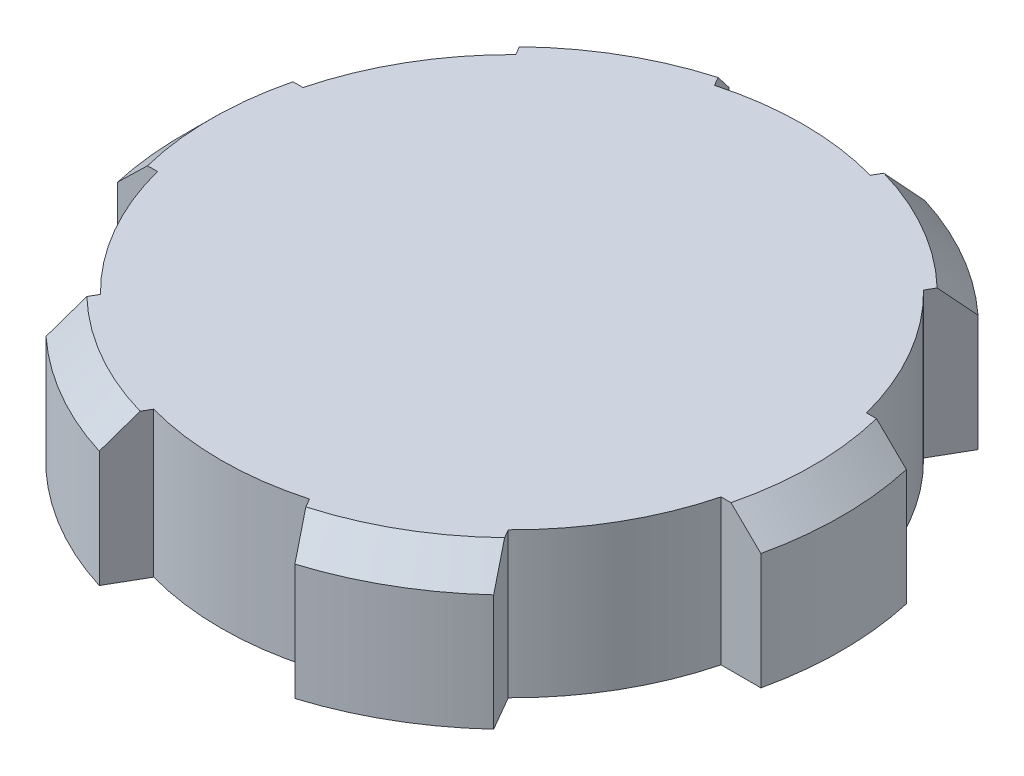
ISO-10303-21;
HEADER;
FILE_DESCRIPTION(('STEP AP214'),'2;1');
FILE_NAME('part.step','',(''),(''),'','','');
FILE_SCHEMA(('AUTOMOTIVE_DESIGN { 1 0 10303 214 1 1 1 1 }'));
ENDSEC;
DATA;
#1=APPLICATION_CONTEXT('core data for automotive mechanical design processes');
#2=APPLICATION_PROTOCOL_DEFINITION('international standard','automotive_design',2000,#1);
#3=PRODUCT_CONTEXT('',#1,'mechanical');
#4=PRODUCT('Part','Part','',(#3));
#5=PRODUCT_RELATED_PRODUCT_CATEGORY('part','',(#4));
#6=PRODUCT_DEFINITION_FORMATION('','',#4);
#7=PRODUCT_DEFINITION_CONTEXT('part definition',#1,'design');
#8=PRODUCT_DEFINITION('design','',#6,#7);
#9=PRODUCT_DEFINITION_SHAPE('','',#8);
#10=(LENGTH_UNIT() NAMED_UNIT(*) SI_UNIT(.MILLI.,.METRE.));
#11=(NAMED_UNIT(*) PLANE_ANGLE_UNIT() SI_UNIT($,.RADIAN.));
#12=(NAMED_UNIT(*) SI_UNIT($,.STERADIAN.) SOLID_ANGLE_UNIT());
#13=UNCERTAINTY_MEASURE_WITH_UNIT(LENGTH_MEASURE(1.E-05),#10,'distance_accuracy_value','');
#14=(GEOMETRIC_REPRESENTATION_CONTEXT(3) GLOBAL_UNCERTAINTY_ASSIGNED_CONTEXT((#13)) GLOBAL_UNIT_ASSIGNED_CONTEXT((#10,
#11,#12)) REPRESENTATION_CONTEXT('',''));
#15=CARTESIAN_POINT('',(0.,0.,0.));
#16=DIRECTION('',(0.,0.,1.));
#17=DIRECTION('',(1.,0.,0.));
#18=AXIS2_PLACEMENT_3D('',#15,#16,#17);
#19=CARTESIAN_POINT('',(0.,5.,0.));
#20=DIRECTION('',(0.,-1.,0.));
#21=DIRECTION('',(0.,0.,-1.));
#22=AXIS2_PLACEMENT_3D('',#19,#20,#21);
#23=CYLINDRICAL_SURFACE('',#22,10.);
#24=CARTESIAN_POINT('',(0.,0.,0.));
#25=DIRECTION('',(0.,1.,0.));
#26=DIRECTION('',(0.,0.,1.));
#27=AXIS2_PLACEMENT_3D('',#24,#25,#26);
#28=CIRCLE('',#27,10.);
#29=CARTESIAN_POINT('',(9.68245836551854,0.,-2.5));
#30=VERTEX_POINT('',#29);
#31=CARTESIAN_POINT('',(7.0062926922204,0.,-7.13525491562418));
#32=VERTEX_POINT('',#31);
#33=EDGE_CURVE('E267',#30,#32,#28,.T.);
#34=ORIENTED_EDGE('',*,*,#33,.T.);
#35=DIRECTION('',(0.,1.,0.));
#36=VECTOR('',#35,1.);
#37=CARTESIAN_POINT('',(7.0062926922204,-6.22460213425261,-7.13525491562418));
#38=LINE('',#37,#36);
#39=CARTESIAN_POINT('',(7.0062926922204,5.,-7.13525491562418));
#40=VERTEX_POINT('',#39);
#41=EDGE_CURVE('E278',#32,#40,#38,.T.);
#42=ORIENTED_EDGE('',*,*,#41,.T.);
#43=CARTESIAN_POINT('',(0.,5.,0.));
#44=DIRECTION('',(0.,1.,0.));
#45=DIRECTION('',(0.,0.,1.));
#46=AXIS2_PLACEMENT_3D('',#43,#44,#45);
#47=CIRCLE('',#46,10.);
#48=CARTESIAN_POINT('',(9.68245836551854,5.,-2.5));
#49=VERTEX_POINT('',#48);
#50=EDGE_CURVE('E405',#49,#40,#47,.T.);
#51=ORIENTED_EDGE('',*,*,#50,.F.);
#52=DIRECTION('',(0.,1.,0.));
#53=VECTOR('',#52,1.);
#54=CARTESIAN_POINT('',(9.68245836551854,-5.26508350095154,-2.5));
#55=LINE('',#54,#53);
#56=EDGE_CURVE('E398',#30,#49,#55,.T.);
#57=ORIENTED_EDGE('',*,*,#56,.F.);
#58=EDGE_LOOP('',(#34,#42,#51,#57));
#59=FACE_BOUND('',#58,.T.);
#60=ADVANCED_FACE('F53',(#59),#23,.T.);
#61=CARTESIAN_POINT('',(-9.68245836551854,0.,2.5));
#62=VERTEX_POINT('',#61);
#63=CARTESIAN_POINT('',(-7.0062926922204,0.,7.13525491562418));
#64=VERTEX_POINT('',#63);
#65=EDGE_CURVE('E411',#62,#64,#28,.T.);
#66=ORIENTED_EDGE('',*,*,#65,.T.);
#67=DIRECTION('',(0.,1.,0.));
#68=VECTOR('',#67,1.);
#69=CARTESIAN_POINT('',(-7.0062926922204,-6.22460213425261,7.13525491562418));
#70=LINE('',#69,#68);
#71=CARTESIAN_POINT('',(-7.0062926922204,5.,7.13525491562418));
#72=VERTEX_POINT('',#71);
#73=EDGE_CURVE('E305',#64,#72,#70,.T.);
#74=ORIENTED_EDGE('',*,*,#73,.T.);
#75=CARTESIAN_POINT('',(-9.68245836551854,5.,2.5));
#76=VERTEX_POINT('',#75);
#77=EDGE_CURVE('E408',#76,#72,#47,.T.);
#78=ORIENTED_EDGE('',*,*,#77,.F.);
#79=DIRECTION('',(0.,1.,0.));
#80=VECTOR('',#79,1.);
#81=CARTESIAN_POINT('',(-9.68245836551854,-5.26508350095154,2.5));
#82=LINE('',#81,#80);
#83=EDGE_CURVE('E374',#62,#76,#82,.T.);
#84=ORIENTED_EDGE('',*,*,#83,.F.);
#85=EDGE_LOOP('',(#66,#74,#78,#84));
#86=FACE_BOUND('',#85,.T.);
#87=ADVANCED_FACE('F660',(#86),#23,.T.);
#88=CARTESIAN_POINT('',(2.67616567329822,5.,-9.6352549156242));
#89=VERTEX_POINT('',#88);
#90=CARTESIAN_POINT('',(-2.67616567329815,5.,-9.63525491562422));
#91=VERTEX_POINT('',#90);
#92=EDGE_CURVE('E275',#89,#91,#47,.T.);
#93=ORIENTED_EDGE('',*,*,#92,.F.);
#94=DIRECTION('',(0.,1.,0.));
#95=VECTOR('',#94,1.);
#96=CARTESIAN_POINT('',(2.67616567329822,-6.22460213425261,-9.6352549156242));
#97=LINE('',#96,#95);
#98=CARTESIAN_POINT('',(2.67616567329822,0.,-9.6352549156242));
#99=VERTEX_POINT('',#98);
#100=EDGE_CURVE('E273',#99,#89,#97,.T.);
#101=ORIENTED_EDGE('',*,*,#100,.F.);
#102=CARTESIAN_POINT('',(-2.67616567329815,0.,-9.63525491562422));
#103=VERTEX_POINT('',#102);
#104=EDGE_CURVE('E256',#99,#103,#28,.T.);
#105=ORIENTED_EDGE('',*,*,#104,.T.);
#106=DIRECTION('',(0.,1.,0.));
#107=VECTOR('',#106,1.);
#108=CARTESIAN_POINT('',(-2.67616567329815,-6.2246021342526,-9.63525491562422));
#109=LINE('',#108,#107);
#110=EDGE_CURVE('E326',#103,#91,#109,.T.);
#111=ORIENTED_EDGE('',*,*,#110,.T.);
#112=EDGE_LOOP('',(#93,#101,#105,#111));
#113=FACE_BOUND('',#112,.T.);
#114=ADVANCED_FACE('F274',(#113),#23,.T.);
#115=CARTESIAN_POINT('',(-2.67616567329822,5.,9.6352549156242));
#116=VERTEX_POINT('',#115);
#117=CARTESIAN_POINT('',(2.67616567329815,5.,9.63525491562422));
#118=VERTEX_POINT('',#117);
#119=EDGE_CURVE('E596',#116,#118,#47,.T.);
#120=ORIENTED_EDGE('',*,*,#119,.F.);
#121=DIRECTION('',(0.,1.,0.));
#122=VECTOR('',#121,1.);
#123=CARTESIAN_POINT('',(-2.67616567329822,-6.22460213425261,9.6352549156242));
#124=LINE('',#123,#122);
#125=CARTESIAN_POINT('',(-2.67616567329822,0.,9.6352549156242));
#126=VERTEX_POINT('',#125);
#127=EDGE_CURVE('E307',#126,#116,#124,.T.);
#128=ORIENTED_EDGE('',*,*,#127,.F.);
#129=CARTESIAN_POINT('',(2.67616567329815,0.,9.63525491562422));
#130=VERTEX_POINT('',#129);
#131=EDGE_CURVE('E270',#126,#130,#28,.T.);
#132=ORIENTED_EDGE('',*,*,#131,.T.);
#133=DIRECTION('',(0.,1.,0.));
#134=VECTOR('',#133,1.);
#135=CARTESIAN_POINT('',(2.67616567329815,-6.2246021342526,9.63525491562422));
#136=LINE('',#135,#134);
#137=EDGE_CURVE('E348',#130,#118,#136,.T.);
#138=ORIENTED_EDGE('',*,*,#137,.T.);
#139=EDGE_LOOP('',(#120,#128,#132,#138));
#140=FACE_BOUND('',#139,.T.);
#141=ADVANCED_FACE('F605',(#140),#23,.T.);
#142=CARTESIAN_POINT('',(-7.00629269222035,5.,-7.13525491562423));
#143=VERTEX_POINT('',#142);
#144=CARTESIAN_POINT('',(-9.68245836551854,5.,-2.5));
#145=VERTEX_POINT('',#144);
#146=EDGE_CURVE('E593',#143,#145,#47,.T.);
#147=ORIENTED_EDGE('',*,*,#146,.F.);
#148=DIRECTION('',(0.,1.,0.));
#149=VECTOR('',#148,1.);
#150=CARTESIAN_POINT('',(-7.00629269222035,-6.2246021342526,-7.13525491562423));
#151=LINE('',#150,#149);
#152=CARTESIAN_POINT('',(-7.00629269222035,0.,-7.13525491562423));
#153=VERTEX_POINT('',#152);
#154=EDGE_CURVE('E328',#153,#143,#151,.T.);
#155=ORIENTED_EDGE('',*,*,#154,.F.);
#156=CARTESIAN_POINT('',(-9.68245836551854,0.,-2.5));
#157=VERTEX_POINT('',#156);
#158=EDGE_CURVE('E268',#153,#157,#28,.T.);
#159=ORIENTED_EDGE('',*,*,#158,.T.);
#160=DIRECTION('',(0.,1.,0.));
#161=VECTOR('',#160,1.);
#162=CARTESIAN_POINT('',(-9.68245836551854,-5.26508350095154,-2.5));
#163=LINE('',#162,#161);
#164=EDGE_CURVE('E371',#157,#145,#163,.T.);
#165=ORIENTED_EDGE('',*,*,#164,.T.);
#166=EDGE_LOOP('',(#147,#155,#159,#165));
#167=FACE_BOUND('',#166,.T.);
#168=ADVANCED_FACE('F592',(#167),#23,.T.);
#169=CARTESIAN_POINT('',(7.00629269222035,5.,7.13525491562423));
#170=VERTEX_POINT('',#169);
#171=CARTESIAN_POINT('',(9.68245836551854,5.,2.5));
#172=VERTEX_POINT('',#171);
#173=EDGE_CURVE('E410',#170,#172,#47,.T.);
#174=ORIENTED_EDGE('',*,*,#173,.F.);
#175=DIRECTION('',(0.,1.,0.));
#176=VECTOR('',#175,1.);
#177=CARTESIAN_POINT('',(7.00629269222035,-6.2246021342526,7.13525491562423));
#178=LINE('',#177,#176);
#179=CARTESIAN_POINT('',(7.00629269222035,0.,7.13525491562423));
#180=VERTEX_POINT('',#179);
#181=EDGE_CURVE('E351',#180,#170,#178,.T.);
#182=ORIENTED_EDGE('',*,*,#181,.F.);
#183=CARTESIAN_POINT('',(9.68245836551854,0.,2.5));
#184=VERTEX_POINT('',#183);
#185=EDGE_CURVE('E404',#180,#184,#28,.T.);
#186=ORIENTED_EDGE('',*,*,#185,.T.);
#187=DIRECTION('',(0.,1.,0.));
#188=VECTOR('',#187,1.);
#189=CARTESIAN_POINT('',(9.68245836551854,-5.26508350095154,2.5));
#190=LINE('',#189,#188);
#191=EDGE_CURVE('E395',#184,#172,#190,.T.);
#192=ORIENTED_EDGE('',*,*,#191,.T.);
#193=EDGE_LOOP('',(#174,#182,#186,#192));
#194=FACE_BOUND('',#193,.T.);
#195=ADVANCED_FACE('F454',(#194),#23,.T.);
#196=CARTESIAN_POINT('',(0.,5.,0.));
#197=DIRECTION('',(0.,1.,0.));
#198=DIRECTION('',(0.,0.,1.));
#199=AXIS2_PLACEMENT_3D('',#196,#197,#198);
#200=PLANE('',#199);
#201=DIRECTION('',(1.,0.,0.));
#202=VECTOR('',#201,1.);
#203=CARTESIAN_POINT('',(9.68245836551854,5.,2.5));
#204=LINE('',#203,#202);
#205=CARTESIAN_POINT('',(10.0250164464143,5.,2.5));
#206=VERTEX_POINT('',#205);
#207=EDGE_CURVE('E389',#172,#206,#204,.T.);
#208=ORIENTED_EDGE('',*,*,#207,.T.);
#209=CARTESIAN_POINT('',(0.,5.,0.));
#210=DIRECTION('',(0.,1.,0.));
#211=DIRECTION('',(0.,0.,1.));
#212=AXIS2_PLACEMENT_3D('',#209,#210,#211);
#213=CIRCLE('',#212,10.3320353634159);
#214=CARTESIAN_POINT('',(10.0250164464143,5.,-2.5));
#215=VERTEX_POINT('',#214);
#216=EDGE_CURVE('E426',#206,#215,#213,.T.);
#217=ORIENTED_EDGE('',*,*,#216,.T.);
#218=DIRECTION('',(-1.,0.,0.));
#219=VECTOR('',#218,1.);
#220=CARTESIAN_POINT('',(9.68245836551854,5.,-2.5));
#221=LINE('',#220,#219);
#222=EDGE_CURVE('E380',#215,#49,#221,.T.);
#223=ORIENTED_EDGE('',*,*,#222,.T.);
#224=ORIENTED_EDGE('',*,*,#50,.T.);
#225=DIRECTION('',(0.500000000000004,0.,-0.866025403784436));
#226=VECTOR('',#225,1.);
#227=CARTESIAN_POINT('',(7.69147793198025,5.,-8.32203056348448));
#228=LINE('',#227,#226);
#229=CARTESIAN_POINT('',(7.17757173266828,5.,-7.43191891595155));
#230=VERTEX_POINT('',#229);
#231=EDGE_CURVE('E636',#40,#230,#228,.T.);
#232=ORIENTED_EDGE('',*,*,#231,.T.);
#233=CARTESIAN_POINT('',(0.,5.,0.));
#234=DIRECTION('',(0.,1.,0.));
#235=DIRECTION('',(0.,0.,1.));
#236=AXIS2_PLACEMENT_3D('',#233,#234,#235);
#237=CIRCLE('',#236,10.3320353634159);
#238=CARTESIAN_POINT('',(2.8474447137461,5.,-9.93191891595157));
#239=VERTEX_POINT('',#238);
#240=EDGE_CURVE('E423',#230,#239,#237,.T.);
#241=ORIENTED_EDGE('',*,*,#240,.T.);
#242=DIRECTION('',(-0.500000000000004,0.,0.866025403784436));
#243=VECTOR('',#242,1.);
#244=CARTESIAN_POINT('',(3.36135091305806,5.,-10.8220305634845));
#245=LINE('',#244,#243);
#246=EDGE_CURVE('E643',#239,#89,#245,.T.);
#247=ORIENTED_EDGE('',*,*,#246,.T.);
#248=ORIENTED_EDGE('',*,*,#92,.T.);
#249=DIRECTION('',(-0.499999999999998,0.,-0.86602540378444));
#250=VECTOR('',#249,1.);
#251=CARTESIAN_POINT('',(-3.36135091305799,5.,-10.8220305634845));
#252=LINE('',#251,#250);
#253=CARTESIAN_POINT('',(-2.84744471374603,5.,-9.93191891595159));
#254=VERTEX_POINT('',#253);
#255=EDGE_CURVE('E320',#91,#254,#252,.T.);
#256=ORIENTED_EDGE('',*,*,#255,.T.);
#257=CARTESIAN_POINT('',(0.,5.,0.));
#258=DIRECTION('',(0.,1.,0.));
#259=DIRECTION('',(0.,0.,1.));
#260=AXIS2_PLACEMENT_3D('',#257,#258,#259);
#261=CIRCLE('',#260,10.3320353634159);
#262=CARTESIAN_POINT('',(-7.17757173266823,5.,-7.4319189159516));
#263=VERTEX_POINT('',#262);
#264=EDGE_CURVE('E420',#254,#263,#261,.T.);
#265=ORIENTED_EDGE('',*,*,#264,.T.);
#266=DIRECTION('',(0.499999999999998,0.,0.86602540378444));
#267=VECTOR('',#266,1.);
#268=CARTESIAN_POINT('',(-7.69147793198019,5.,-8.32203056348453));
#269=LINE('',#268,#267);
#270=EDGE_CURVE('E313',#263,#143,#269,.T.);
#271=ORIENTED_EDGE('',*,*,#270,.T.);
#272=ORIENTED_EDGE('',*,*,#146,.T.);
#273=DIRECTION('',(-1.,0.,0.));
#274=VECTOR('',#273,1.);
#275=CARTESIAN_POINT('',(-11.0528288450382,5.,-2.5));
#276=LINE('',#275,#274);
#277=CARTESIAN_POINT('',(-10.0250164464143,5.,-2.5));
#278=VERTEX_POINT('',#277);
#279=EDGE_CURVE('E365',#145,#278,#276,.T.);
#280=ORIENTED_EDGE('',*,*,#279,.T.);
#281=CARTESIAN_POINT('',(0.,5.,0.));
#282=DIRECTION('',(0.,1.,0.));
#283=DIRECTION('',(0.,0.,1.));
#284=AXIS2_PLACEMENT_3D('',#281,#282,#283);
#285=CIRCLE('',#284,10.3320353634159);
#286=CARTESIAN_POINT('',(-10.0250164464143,5.,2.5));
#287=VERTEX_POINT('',#286);
#288=EDGE_CURVE('E417',#278,#287,#285,.T.);
#289=ORIENTED_EDGE('',*,*,#288,.T.);
#290=DIRECTION('',(1.,0.,0.));
#291=VECTOR('',#290,1.);
#292=CARTESIAN_POINT('',(-11.0528288450382,5.,2.5));
#293=LINE('',#292,#291);
#294=EDGE_CURVE('E356',#287,#76,#293,.T.);
#295=ORIENTED_EDGE('',*,*,#294,.T.);
#296=ORIENTED_EDGE('',*,*,#77,.T.);
#297=DIRECTION('',(-0.500000000000004,0.,0.866025403784436));
#298=VECTOR('',#297,1.);
#299=CARTESIAN_POINT('',(-7.0062926922204,5.,7.13525491562418));
#300=LINE('',#299,#298);
#301=CARTESIAN_POINT('',(-7.17757173266828,5.,7.43191891595155));
#302=VERTEX_POINT('',#301);
#303=EDGE_CURVE('E287',#72,#302,#300,.T.);
#304=ORIENTED_EDGE('',*,*,#303,.T.);
#305=CARTESIAN_POINT('',(0.,5.,0.));
#306=DIRECTION('',(0.,1.,0.));
#307=DIRECTION('',(0.,0.,1.));
#308=AXIS2_PLACEMENT_3D('',#305,#306,#307);
#309=CIRCLE('',#308,10.3320353634159);
#310=CARTESIAN_POINT('',(-2.8474447137461,5.,9.93191891595157));
#311=VERTEX_POINT('',#310);
#312=EDGE_CURVE('E414',#302,#311,#309,.T.);
#313=ORIENTED_EDGE('',*,*,#312,.T.);
#314=DIRECTION('',(0.500000000000004,0.,-0.866025403784436));
#315=VECTOR('',#314,1.);
#316=CARTESIAN_POINT('',(-2.67616567329822,5.,9.6352549156242));
#317=LINE('',#316,#315);
#318=EDGE_CURVE('E284',#311,#116,#317,.T.);
#319=ORIENTED_EDGE('',*,*,#318,.T.);
#320=ORIENTED_EDGE('',*,*,#119,.T.);
#321=DIRECTION('',(0.499999999999998,0.,0.86602540378444));
#322=VECTOR('',#321,1.);
#323=CARTESIAN_POINT('',(2.67616567329815,5.,9.63525491562422));
#324=LINE('',#323,#322);
#325=CARTESIAN_POINT('',(2.84744471374603,5.,9.93191891595158));
#326=VERTEX_POINT('',#325);
#327=EDGE_CURVE('E343',#118,#326,#324,.T.);
#328=ORIENTED_EDGE('',*,*,#327,.T.);
#329=CARTESIAN_POINT('',(0.,5.,0.));
#330=DIRECTION('',(0.,1.,0.));
#331=DIRECTION('',(0.,0.,1.));
#332=AXIS2_PLACEMENT_3D('',#329,#330,#331);
#333=CIRCLE('',#332,10.3320353634159);
#334=CARTESIAN_POINT('',(7.17757173266823,5.,7.4319189159516));
#335=VERTEX_POINT('',#334);
#336=EDGE_CURVE('E407',#326,#335,#333,.T.);
#337=ORIENTED_EDGE('',*,*,#336,.T.);
#338=DIRECTION('',(-0.499999999999998,0.,-0.86602540378444));
#339=VECTOR('',#338,1.);
#340=CARTESIAN_POINT('',(7.00629269222035,5.,7.13525491562423));
#341=LINE('',#340,#339);
#342=EDGE_CURVE('E334',#335,#170,#341,.T.);
#343=ORIENTED_EDGE('',*,*,#342,.T.);
#344=ORIENTED_EDGE('',*,*,#173,.T.);
#345=EDGE_LOOP('',(#208,#217,#223,#224,#232,#241,#247,#248,#256,#265,#271,#272,#280,#289,#295,
#296,#304,#313,#319,#320,#328,#337,#343,#344));
#346=FACE_BOUND('',#345,.T.);
#347=ADVANCED_FACE('F584',(#346),#200,.T.);
#348=CARTESIAN_POINT('',(0.,0.,0.));
#349=DIRECTION('',(0.,1.,0.));
#350=DIRECTION('',(0.,0.,1.));
#351=AXIS2_PLACEMENT_3D('',#348,#349,#350);
#352=PLANE('',#351);
#353=ORIENTED_EDGE('',*,*,#33,.F.);
#354=DIRECTION('',(1.,0.,0.));
#355=VECTOR('',#354,1.);
#356=CARTESIAN_POINT('',(9.68245836551854,0.,-2.5));
#357=LINE('',#356,#355);
#358=CARTESIAN_POINT('',(11.0528288450382,0.,-2.5));
#359=VERTEX_POINT('',#358);
#360=EDGE_CURVE('E387',#30,#359,#357,.T.);
#361=ORIENTED_EDGE('',*,*,#360,.T.);
#362=CARTESIAN_POINT('',(0.,0.,0.));
#363=DIRECTION('',(0.,1.,0.));
#364=DIRECTION('',(0.,0.,1.));
#365=AXIS2_PLACEMENT_3D('',#362,#363,#364);
#366=CIRCLE('',#365,11.3320353634159);
#367=CARTESIAN_POINT('',(11.0528288450382,0.,2.5));
#368=VERTEX_POINT('',#367);
#369=EDGE_CURVE('E384',#359,#368,#366,.F.);
#370=ORIENTED_EDGE('',*,*,#369,.T.);
#371=DIRECTION('',(-1.,0.,0.));
#372=VECTOR('',#371,1.);
#373=CARTESIAN_POINT('',(9.68245836551854,0.,2.5));
#374=LINE('',#373,#372);
#375=EDGE_CURVE('E381',#368,#184,#374,.T.);
#376=ORIENTED_EDGE('',*,*,#375,.T.);
#377=ORIENTED_EDGE('',*,*,#185,.F.);
#378=DIRECTION('',(0.499999999999998,0.,0.86602540378444));
#379=VECTOR('',#378,1.);
#380=CARTESIAN_POINT('',(7.00629269222035,0.,7.13525491562423));
#381=LINE('',#380,#379);
#382=CARTESIAN_POINT('',(7.69147793198019,0.,8.32203056348454));
#383=VERTEX_POINT('',#382);
#384=EDGE_CURVE('E341',#180,#383,#381,.T.);
#385=ORIENTED_EDGE('',*,*,#384,.T.);
#386=CARTESIAN_POINT('',(0.,0.,0.));
#387=DIRECTION('',(0.,1.,0.));
#388=DIRECTION('',(0.,0.,1.));
#389=AXIS2_PLACEMENT_3D('',#386,#387,#388);
#390=CIRCLE('',#389,11.3320353634159);
#391=CARTESIAN_POINT('',(3.36135091305799,0.,10.8220305634845));
#392=VERTEX_POINT('',#391);
#393=EDGE_CURVE('E338',#383,#392,#390,.F.);
#394=ORIENTED_EDGE('',*,*,#393,.T.);
#395=DIRECTION('',(-0.499999999999998,0.,-0.86602540378444));
#396=VECTOR('',#395,1.);
#397=CARTESIAN_POINT('',(2.67616567329815,0.,9.63525491562422));
#398=LINE('',#397,#396);
#399=EDGE_CURVE('E335',#392,#130,#398,.T.);
#400=ORIENTED_EDGE('',*,*,#399,.T.);
#401=ORIENTED_EDGE('',*,*,#131,.F.);
#402=DIRECTION('',(-0.500000000000004,0.,0.866025403784436));
#403=VECTOR('',#402,1.);
#404=CARTESIAN_POINT('',(-2.67616567329822,0.,9.6352549156242));
#405=LINE('',#404,#403);
#406=CARTESIAN_POINT('',(-3.36135091305806,0.,10.8220305634845));
#407=VERTEX_POINT('',#406);
#408=EDGE_CURVE('E298',#126,#407,#405,.T.);
#409=ORIENTED_EDGE('',*,*,#408,.T.);
#410=CARTESIAN_POINT('',(0.,0.,0.));
#411=DIRECTION('',(0.,1.,0.));
#412=DIRECTION('',(0.,0.,1.));
#413=AXIS2_PLACEMENT_3D('',#410,#411,#412);
#414=CIRCLE('',#413,11.3320353634159);
#415=CARTESIAN_POINT('',(-7.69147793198025,0.,8.32203056348448));
#416=VERTEX_POINT('',#415);
#417=EDGE_CURVE('E296',#407,#416,#414,.F.);
#418=ORIENTED_EDGE('',*,*,#417,.T.);
#419=DIRECTION('',(0.500000000000004,0.,-0.866025403784436));
#420=VECTOR('',#419,1.);
#421=CARTESIAN_POINT('',(-7.0062926922204,0.,7.13525491562418));
#422=LINE('',#421,#420);
#423=EDGE_CURVE('E293',#416,#64,#422,.T.);
#424=ORIENTED_EDGE('',*,*,#423,.T.);
#425=ORIENTED_EDGE('',*,*,#65,.F.);
#426=DIRECTION('',(-1.,0.,0.));
#427=VECTOR('',#426,1.);
#428=CARTESIAN_POINT('',(-11.0528288450382,0.,2.5));
#429=LINE('',#428,#427);
#430=CARTESIAN_POINT('',(-11.0528288450382,0.,2.5));
#431=VERTEX_POINT('',#430);
#432=EDGE_CURVE('E363',#62,#431,#429,.T.);
#433=ORIENTED_EDGE('',*,*,#432,.T.);
#434=CARTESIAN_POINT('',(0.,0.,0.));
#435=DIRECTION('',(0.,1.,0.));
#436=DIRECTION('',(0.,0.,1.));
#437=AXIS2_PLACEMENT_3D('',#434,#435,#436);
#438=CIRCLE('',#437,11.3320353634159);
#439=CARTESIAN_POINT('',(-11.0528288450382,0.,-2.5));
#440=VERTEX_POINT('',#439);
#441=EDGE_CURVE('E360',#431,#440,#438,.F.);
#442=ORIENTED_EDGE('',*,*,#441,.T.);
#443=DIRECTION('',(1.,0.,0.));
#444=VECTOR('',#443,1.);
#445=CARTESIAN_POINT('',(-11.0528288450382,0.,-2.5));
#446=LINE('',#445,#444);
#447=EDGE_CURVE('E357',#440,#157,#446,.T.);
#448=ORIENTED_EDGE('',*,*,#447,.T.);
#449=ORIENTED_EDGE('',*,*,#158,.F.);
#450=DIRECTION('',(-0.499999999999998,0.,-0.86602540378444));
#451=VECTOR('',#450,1.);
#452=CARTESIAN_POINT('',(-7.69147793198019,0.,-8.32203056348453));
#453=LINE('',#452,#451);
#454=CARTESIAN_POINT('',(-7.69147793198019,0.,-8.32203056348453));
#455=VERTEX_POINT('',#454);
#456=EDGE_CURVE('E318',#153,#455,#453,.T.);
#457=ORIENTED_EDGE('',*,*,#456,.T.);
#458=CARTESIAN_POINT('',(0.,0.,0.));
#459=DIRECTION('',(0.,1.,0.));
#460=DIRECTION('',(0.,0.,1.));
#461=AXIS2_PLACEMENT_3D('',#458,#459,#460);
#462=CIRCLE('',#461,11.3320353634159);
#463=CARTESIAN_POINT('',(-3.36135091305799,0.,-10.8220305634845));
#464=VERTEX_POINT('',#463);
#465=EDGE_CURVE('E315',#455,#464,#462,.F.);
#466=ORIENTED_EDGE('',*,*,#465,.T.);
#467=DIRECTION('',(0.499999999999998,0.,0.86602540378444));
#468=VECTOR('',#467,1.);
#469=CARTESIAN_POINT('',(-3.36135091305799,0.,-10.8220305634845));
#470=LINE('',#469,#468);
#471=EDGE_CURVE('E263',#464,#103,#470,.T.);
#472=ORIENTED_EDGE('',*,*,#471,.T.);
#473=ORIENTED_EDGE('',*,*,#104,.F.);
#474=DIRECTION('',(0.500000000000004,0.,-0.866025403784436));
#475=VECTOR('',#474,1.);
#476=CARTESIAN_POINT('',(3.36135091305806,0.,-10.8220305634845));
#477=LINE('',#476,#475);
#478=CARTESIAN_POINT('',(3.36135091305806,0.,-10.8220305634845));
#479=VERTEX_POINT('',#478);
#480=EDGE_CURVE('E260',#99,#479,#477,.T.);
#481=ORIENTED_EDGE('',*,*,#480,.T.);
#482=CARTESIAN_POINT('',(0.,0.,0.));
#483=DIRECTION('',(0.,1.,0.));
#484=DIRECTION('',(0.,0.,1.));
#485=AXIS2_PLACEMENT_3D('',#482,#483,#484);
#486=CIRCLE('',#485,11.3320353634159);
#487=CARTESIAN_POINT('',(7.69147793198025,0.,-8.32203056348448));
#488=VERTEX_POINT('',#487);
#489=EDGE_CURVE('E285',#479,#488,#486,.F.);
#490=ORIENTED_EDGE('',*,*,#489,.T.);
#491=DIRECTION('',(-0.500000000000004,0.,0.866025403784436));
#492=VECTOR('',#491,1.);
#493=CARTESIAN_POINT('',(7.69147793198025,0.,-8.32203056348448));
#494=LINE('',#493,#492);
#495=EDGE_CURVE('E289',#488,#32,#494,.T.);
#496=ORIENTED_EDGE('',*,*,#495,.T.);
#497=EDGE_LOOP('',(#353,#361,#370,#376,#377,#385,#394,#400,#401,#409,#418,#424,#425,#433,#442,
#448,#449,#457,#466,#472,#473,#481,#490,#496));
#498=FACE_BOUND('',#497,.T.);
#499=ADVANCED_FACE('F258',(#498),#352,.F.);
#500=CARTESIAN_POINT('',(0.,-5.26508350095154,0.));
#501=DIRECTION('',(0.,1.,0.));
#502=DIRECTION('',(0.,0.,1.));
#503=AXIS2_PLACEMENT_3D('',#500,#501,#502);
#504=CYLINDRICAL_SURFACE('',#503,11.3320353634159);
#505=DIRECTION('',(0.,1.,0.));
#506=VECTOR('',#505,1.);
#507=CARTESIAN_POINT('',(11.0528288450382,-5.26508350095154,-2.5));
#508=LINE('',#507,#506);
#509=CARTESIAN_POINT('',(11.0528288450382,3.99999999999999,-2.5));
#510=VERTEX_POINT('',#509);
#511=EDGE_CURVE('E392',#359,#510,#508,.T.);
#512=ORIENTED_EDGE('',*,*,#511,.T.);
#513=CARTESIAN_POINT('',(0.,3.99999999999999,0.));
#514=DIRECTION('',(0.,1.,0.));
#515=DIRECTION('',(0.,0.,1.));
#516=AXIS2_PLACEMENT_3D('',#513,#514,#515);
#517=CIRCLE('',#516,11.3320353634159);
#518=CARTESIAN_POINT('',(11.0528288450382,3.99999999999999,2.5));
#519=VERTEX_POINT('',#518);
#520=EDGE_CURVE('E437',#510,#519,#517,.F.);
#521=ORIENTED_EDGE('',*,*,#520,.T.);
#522=DIRECTION('',(0.,1.,0.));
#523=VECTOR('',#522,1.);
#524=CARTESIAN_POINT('',(11.0528288450382,-5.26508350095154,2.5));
#525=LINE('',#524,#523);
#526=EDGE_CURVE('E385',#368,#519,#525,.T.);
#527=ORIENTED_EDGE('',*,*,#526,.F.);
#528=ORIENTED_EDGE('',*,*,#369,.F.);
#529=EDGE_LOOP('',(#512,#521,#527,#528));
#530=FACE_BOUND('',#529,.T.);
#531=ADVANCED_FACE('F476',(#530),#504,.T.);
#532=CARTESIAN_POINT('',(9.68245836551854,-5.26508350095154,2.5));
#533=DIRECTION('',(0.,0.,1.));
#534=DIRECTION('',(1.,0.,0.));
#535=AXIS2_PLACEMENT_3D('',#532,#533,#534);
#536=PLANE('',#535);
#537=ORIENTED_EDGE('',*,*,#526,.T.);
#538=CARTESIAN_POINT('',(11.0528288450382,3.99999999999999,2.5));
#539=CARTESIAN_POINT('',(10.8817436431512,4.16688955604381,2.5));
#540=CARTESIAN_POINT('',(10.7105500106647,4.33366766577301,2.5));
#541=CARTESIAN_POINT('',(10.3679458777985,4.66700099911506,2.5));
#542=CARTESIAN_POINT('',(10.1965353774104,4.83355622271919,2.5));
#543=CARTESIAN_POINT('',(10.0250164464143,5.,2.5));
#544=B_SPLINE_CURVE_WITH_KNOTS('',3,(#538,#539,#540,#541,#542,#543),.UNSPECIFIED.,.F.,.F.,(4,2,
4),(0.,0.717007516835812,1.43401506169018),.UNSPECIFIED.);
#545=EDGE_CURVE('E459',#519,#206,#544,.T.);
#546=ORIENTED_EDGE('',*,*,#545,.T.);
#547=ORIENTED_EDGE('',*,*,#207,.F.);
#548=ORIENTED_EDGE('',*,*,#191,.F.);
#549=ORIENTED_EDGE('',*,*,#375,.F.);
#550=EDGE_LOOP('',(#537,#546,#547,#548,#549));
#551=FACE_BOUND('',#550,.T.);
#552=ADVANCED_FACE('F472',(#551),#536,.T.);
#553=CARTESIAN_POINT('',(9.68245836551854,-5.26508350095154,-2.5));
#554=DIRECTION('',(0.,0.,-1.));
#555=DIRECTION('',(-1.,0.,0.));
#556=AXIS2_PLACEMENT_3D('',#553,#554,#555);
#557=PLANE('',#556);
#558=ORIENTED_EDGE('',*,*,#222,.F.);
#559=CARTESIAN_POINT('',(10.0250164464143,5.,-2.5));
#560=CARTESIAN_POINT('',(10.1965353774104,4.83355622271919,-2.5));
#561=CARTESIAN_POINT('',(10.3679458777985,4.66700099911506,-2.5));
#562=CARTESIAN_POINT('',(10.7105500106647,4.33366766577302,-2.5));
#563=CARTESIAN_POINT('',(10.8817436431512,4.16688955604381,-2.5));
#564=CARTESIAN_POINT('',(11.0528288450382,3.99999999999999,-2.5));
#565=B_SPLINE_CURVE_WITH_KNOTS('',3,(#559,#560,#561,#562,#563,#564),.UNSPECIFIED.,.F.,.F.,(4,2,
4),(0.,0.717007544854372,1.43401506169018),.UNSPECIFIED.);
#566=EDGE_CURVE('E429',#215,#510,#565,.T.);
#567=ORIENTED_EDGE('',*,*,#566,.T.);
#568=ORIENTED_EDGE('',*,*,#511,.F.);
#569=ORIENTED_EDGE('',*,*,#360,.F.);
#570=ORIENTED_EDGE('',*,*,#56,.T.);
#571=EDGE_LOOP('',(#558,#567,#568,#569,#570));
#572=FACE_BOUND('',#571,.T.);
#573=ADVANCED_FACE('F439',(#572),#557,.T.);
#574=CARTESIAN_POINT('',(0.,-5.26508350095154,0.));
#575=DIRECTION('',(0.,1.,0.));
#576=DIRECTION('',(0.,0.,1.));
#577=AXIS2_PLACEMENT_3D('',#574,#575,#576);
#578=CYLINDRICAL_SURFACE('',#577,11.3320353634159);
#579=DIRECTION('',(0.,1.,0.));
#580=VECTOR('',#579,1.);
#581=CARTESIAN_POINT('',(-11.0528288450382,-5.26508350095154,2.5));
#582=LINE('',#581,#580);
#583=CARTESIAN_POINT('',(-11.0528288450382,3.99999999999999,2.5));
#584=VERTEX_POINT('',#583);
#585=EDGE_CURVE('E368',#431,#584,#582,.T.);
#586=ORIENTED_EDGE('',*,*,#585,.T.);
#587=CARTESIAN_POINT('',(0.,3.99999999999999,0.));
#588=DIRECTION('',(0.,1.,0.));
#589=DIRECTION('',(0.,0.,1.));
#590=AXIS2_PLACEMENT_3D('',#587,#588,#589);
#591=CIRCLE('',#590,11.3320353634159);
#592=CARTESIAN_POINT('',(-11.0528288450382,3.99999999999999,-2.5));
#593=VERTEX_POINT('',#592);
#594=EDGE_CURVE('E500',#584,#593,#591,.F.);
#595=ORIENTED_EDGE('',*,*,#594,.T.);
#596=DIRECTION('',(0.,1.,0.));
#597=VECTOR('',#596,1.);
#598=CARTESIAN_POINT('',(-11.0528288450382,-5.26508350095154,-2.5));
#599=LINE('',#598,#597);
#600=EDGE_CURVE('E361',#440,#593,#599,.T.);
#601=ORIENTED_EDGE('',*,*,#600,.F.);
#602=ORIENTED_EDGE('',*,*,#441,.F.);
#603=EDGE_LOOP('',(#586,#595,#601,#602));
#604=FACE_BOUND('',#603,.T.);
#605=ADVANCED_FACE('F478',(#604),#578,.T.);
#606=CARTESIAN_POINT('',(-11.0528288450382,-5.26508350095154,-2.5));
#607=DIRECTION('',(0.,0.,-1.));
#608=DIRECTION('',(-1.,0.,0.));
#609=AXIS2_PLACEMENT_3D('',#606,#607,#608);
#610=PLANE('',#609);
#611=ORIENTED_EDGE('',*,*,#600,.T.);
#612=CARTESIAN_POINT('',(-11.0528288450382,3.99999999999999,-2.5));
#613=CARTESIAN_POINT('',(-10.8817436431512,4.16688955604381,-2.5));
#614=CARTESIAN_POINT('',(-10.7105500106647,4.33366766577301,-2.5));
#615=CARTESIAN_POINT('',(-10.3679458777985,4.66700099911506,-2.5));
#616=CARTESIAN_POINT('',(-10.1965353774104,4.83355622271919,-2.5));
#617=CARTESIAN_POINT('',(-10.0250164464143,5.,-2.5));
#618=B_SPLINE_CURVE_WITH_KNOTS('',3,(#612,#613,#614,#615,#616,#617),.UNSPECIFIED.,.F.,.F.,(4,2,
4),(0.,0.717007516835812,1.43401506169018),.UNSPECIFIED.);
#619=EDGE_CURVE('E523',#593,#278,#618,.T.);
#620=ORIENTED_EDGE('',*,*,#619,.T.);
#621=ORIENTED_EDGE('',*,*,#279,.F.);
#622=ORIENTED_EDGE('',*,*,#164,.F.);
#623=ORIENTED_EDGE('',*,*,#447,.F.);
#624=EDGE_LOOP('',(#611,#620,#621,#622,#623));
#625=FACE_BOUND('',#624,.T.);
#626=ADVANCED_FACE('F481',(#625),#610,.T.);
#627=CARTESIAN_POINT('',(-11.0528288450382,-5.26508350095154,2.5));
#628=DIRECTION('',(0.,0.,1.));
#629=DIRECTION('',(1.,0.,0.));
#630=AXIS2_PLACEMENT_3D('',#627,#628,#629);
#631=PLANE('',#630);
#632=ORIENTED_EDGE('',*,*,#294,.F.);
#633=CARTESIAN_POINT('',(-10.0250164464143,5.,2.5));
#634=CARTESIAN_POINT('',(-10.1965353774104,4.83355622271919,2.5));
#635=CARTESIAN_POINT('',(-10.3679458777985,4.66700099911506,2.5));
#636=CARTESIAN_POINT('',(-10.7105500106647,4.33366766577302,2.5));
#637=CARTESIAN_POINT('',(-10.8817436431512,4.16688955604381,2.5));
#638=CARTESIAN_POINT('',(-11.0528288450382,3.99999999999999,2.5));
#639=B_SPLINE_CURVE_WITH_KNOTS('',3,(#633,#634,#635,#636,#637,#638),.UNSPECIFIED.,.F.,.F.,(4,2,
4),(0.,0.717007544854372,1.43401506169018),.UNSPECIFIED.);
#640=EDGE_CURVE('E492',#287,#584,#639,.T.);
#641=ORIENTED_EDGE('',*,*,#640,.T.);
#642=ORIENTED_EDGE('',*,*,#585,.F.);
#643=ORIENTED_EDGE('',*,*,#432,.F.);
#644=ORIENTED_EDGE('',*,*,#83,.T.);
#645=EDGE_LOOP('',(#632,#641,#642,#643,#644));
#646=FACE_BOUND('',#645,.T.);
#647=ADVANCED_FACE('F483',(#646),#631,.T.);
#648=CARTESIAN_POINT('',(0.,-6.2246021342526,0.));
#649=DIRECTION('',(0.,1.,0.));
#650=DIRECTION('',(0.,0.,1.));
#651=AXIS2_PLACEMENT_3D('',#648,#649,#650);
#652=CYLINDRICAL_SURFACE('',#651,11.3320353634159);
#653=DIRECTION('',(0.,1.,0.));
#654=VECTOR('',#653,1.);
#655=CARTESIAN_POINT('',(7.69147793198019,-6.2246021342526,8.32203056348454));
#656=LINE('',#655,#654);
#657=CARTESIAN_POINT('',(7.69147793198019,3.99999999999999,8.32203056348454));
#658=VERTEX_POINT('',#657);
#659=EDGE_CURVE('E346',#383,#658,#656,.T.);
#660=ORIENTED_EDGE('',*,*,#659,.T.);
#661=CARTESIAN_POINT('',(0.,3.99999999999999,0.));
#662=DIRECTION('',(0.,1.,0.));
#663=DIRECTION('',(0.,0.,1.));
#664=AXIS2_PLACEMENT_3D('',#661,#662,#663);
#665=CIRCLE('',#664,11.3320353634159);
#666=CARTESIAN_POINT('',(3.36135091305799,3.99999999999999,10.8220305634845));
#667=VERTEX_POINT('',#666);
#668=EDGE_CURVE('E68',#658,#667,#665,.F.);
#669=ORIENTED_EDGE('',*,*,#668,.T.);
#670=DIRECTION('',(0.,1.,0.));
#671=VECTOR('',#670,1.);
#672=CARTESIAN_POINT('',(3.36135091305799,-6.2246021342526,10.8220305634845));
#673=LINE('',#672,#671);
#674=EDGE_CURVE('E339',#392,#667,#673,.T.);
#675=ORIENTED_EDGE('',*,*,#674,.F.);
#676=ORIENTED_EDGE('',*,*,#393,.F.);
#677=EDGE_LOOP('',(#660,#669,#675,#676));
#678=FACE_BOUND('',#677,.T.);
#679=ADVANCED_FACE('F487',(#678),#652,.T.);
#680=CARTESIAN_POINT('',(2.67616567329815,-6.2246021342526,9.63525491562422));
#681=DIRECTION('',(-0.86602540378444,0.,0.499999999999998));
#682=DIRECTION('',(0.499999999999998,0.,0.86602540378444));
#683=AXIS2_PLACEMENT_3D('',#680,#681,#682);
#684=PLANE('',#683);
#685=ORIENTED_EDGE('',*,*,#674,.T.);
#686=CARTESIAN_POINT('',(3.36135091305799,3.99999999999999,10.8220305634845));
#687=CARTESIAN_POINT('',(3.2758083121145,4.16688955604381,10.6738664324388));
#688=CARTESIAN_POINT('',(3.19021149587123,4.33366766577302,10.5256083977393));
#689=CARTESIAN_POINT('',(3.01890942943815,4.66700099911506,10.2289045152357));
#690=CARTESIAN_POINT('',(2.93320417924409,4.83355622271919,10.0804586674242));
#691=CARTESIAN_POINT('',(2.84744471374603,5.,9.93191891595158));
#692=B_SPLINE_CURVE_WITH_KNOTS('',3,(#686,#687,#688,#689,#690,#691),.UNSPECIFIED.,.F.,.F.,(4,2,
4),(0.,0.717007516835811,1.43401506169018),.UNSPECIFIED.);
#693=EDGE_CURVE('E13',#667,#326,#692,.T.);
#694=ORIENTED_EDGE('',*,*,#693,.T.);
#695=ORIENTED_EDGE('',*,*,#327,.F.);
#696=ORIENTED_EDGE('',*,*,#137,.F.);
#697=ORIENTED_EDGE('',*,*,#399,.F.);
#698=EDGE_LOOP('',(#685,#694,#695,#696,#697));
#699=FACE_BOUND('',#698,.T.);
#700=ADVANCED_FACE('F608',(#699),#684,.T.);
#701=CARTESIAN_POINT('',(7.00629269222035,-6.2246021342526,7.13525491562423));
#702=DIRECTION('',(0.86602540378444,0.,-0.499999999999998));
#703=DIRECTION('',(-0.499999999999998,0.,-0.86602540378444));
#704=AXIS2_PLACEMENT_3D('',#701,#702,#703);
#705=PLANE('',#704);
#706=ORIENTED_EDGE('',*,*,#342,.F.);
#707=CARTESIAN_POINT('',(7.17757173266823,5.,7.4319189159516));
#708=CARTESIAN_POINT('',(7.26333119816629,4.83355622271919,7.5804586674242));
#709=CARTESIAN_POINT('',(7.34903644836034,4.66700099911506,7.72890451523569));
#710=CARTESIAN_POINT('',(7.52033851479343,4.33366766577302,8.02560839773934));
#711=CARTESIAN_POINT('',(7.6059353310367,4.16688955604381,8.17386643243882));
#712=CARTESIAN_POINT('',(7.69147793198019,3.99999999999999,8.32203056348454));
#713=B_SPLINE_CURVE_WITH_KNOTS('',3,(#707,#708,#709,#710,#711,#712),.UNSPECIFIED.,.F.,.F.,(4,2,
4),(0.,0.717007544854369,1.43401506169018),.UNSPECIFIED.);
#714=EDGE_CURVE('E82',#335,#658,#713,.T.);
#715=ORIENTED_EDGE('',*,*,#714,.T.);
#716=ORIENTED_EDGE('',*,*,#659,.F.);
#717=ORIENTED_EDGE('',*,*,#384,.F.);
#718=ORIENTED_EDGE('',*,*,#181,.T.);
#719=EDGE_LOOP('',(#706,#715,#716,#717,#718));
#720=FACE_BOUND('',#719,.T.);
#721=ADVANCED_FACE('F612',(#720),#705,.T.);
#722=CARTESIAN_POINT('',(0.,-6.2246021342526,0.));
#723=DIRECTION('',(0.,1.,0.));
#724=DIRECTION('',(0.,0.,1.));
#725=AXIS2_PLACEMENT_3D('',#722,#723,#724);
#726=CYLINDRICAL_SURFACE('',#725,11.3320353634159);
#727=DIRECTION('',(0.,1.,0.));
#728=VECTOR('',#727,1.);
#729=CARTESIAN_POINT('',(-7.69147793198019,-6.2246021342526,-8.32203056348453));
#730=LINE('',#729,#728);
#731=CARTESIAN_POINT('',(-7.69147793198019,4.,-8.32203056348453));
#732=VERTEX_POINT('',#731);
#733=EDGE_CURVE('E323',#455,#732,#730,.T.);
#734=ORIENTED_EDGE('',*,*,#733,.T.);
#735=CARTESIAN_POINT('',(0.,4.,0.));
#736=DIRECTION('',(0.,1.,0.));
#737=DIRECTION('',(0.,0.,1.));
#738=AXIS2_PLACEMENT_3D('',#735,#736,#737);
#739=CIRCLE('',#738,11.3320353634159);
#740=CARTESIAN_POINT('',(-3.36135091305799,4.,-10.8220305634845));
#741=VERTEX_POINT('',#740);
#742=EDGE_CURVE('E569',#732,#741,#739,.F.);
#743=ORIENTED_EDGE('',*,*,#742,.T.);
#744=DIRECTION('',(0.,1.,0.));
#745=VECTOR('',#744,1.);
#746=CARTESIAN_POINT('',(-3.36135091305799,-6.2246021342526,-10.8220305634845));
#747=LINE('',#746,#745);
#748=EDGE_CURVE('E316',#464,#741,#747,.T.);
#749=ORIENTED_EDGE('',*,*,#748,.F.);
#750=ORIENTED_EDGE('',*,*,#465,.F.);
#751=EDGE_LOOP('',(#734,#743,#749,#750));
#752=FACE_BOUND('',#751,.T.);
#753=ADVANCED_FACE('F556',(#752),#726,.T.);
#754=CARTESIAN_POINT('',(-3.36135091305799,-6.2246021342526,-10.8220305634845));
#755=DIRECTION('',(0.86602540378444,0.,-0.499999999999998));
#756=DIRECTION('',(-0.499999999999998,0.,-0.86602540378444));
#757=AXIS2_PLACEMENT_3D('',#754,#755,#756);
#758=PLANE('',#757);
#759=ORIENTED_EDGE('',*,*,#748,.T.);
#760=CARTESIAN_POINT('',(-3.36135091305799,4.,-10.8220305634845));
#761=CARTESIAN_POINT('',(-3.2758083121145,4.16688955604381,-10.6738664324388));
#762=CARTESIAN_POINT('',(-3.19021149587123,4.33366766577302,-10.5256083977393));
#763=CARTESIAN_POINT('',(-3.01890942943814,4.66700099911506,-10.2289045152357));
#764=CARTESIAN_POINT('',(-2.93320417924409,4.83355622271919,-10.0804586674242));
#765=CARTESIAN_POINT('',(-2.84744471374603,5.,-9.93191891595159));
#766=B_SPLINE_CURVE_WITH_KNOTS('',3,(#760,#761,#762,#763,#764,#765),.UNSPECIFIED.,.F.,.F.,(4,2,
4),(0.,0.717007516835806,1.43401506169017),.UNSPECIFIED.);
#767=EDGE_CURVE('E501',#741,#254,#766,.T.);
#768=ORIENTED_EDGE('',*,*,#767,.T.);
#769=ORIENTED_EDGE('',*,*,#255,.F.);
#770=ORIENTED_EDGE('',*,*,#110,.F.);
#771=ORIENTED_EDGE('',*,*,#471,.F.);
#772=EDGE_LOOP('',(#759,#768,#769,#770,#771));
#773=FACE_BOUND('',#772,.T.);
#774=ADVANCED_FACE('F552',(#773),#758,.T.);
#775=CARTESIAN_POINT('',(-7.69147793198019,-6.2246021342526,-8.32203056348453));
#776=DIRECTION('',(-0.86602540378444,0.,0.499999999999998));
#777=DIRECTION('',(0.499999999999998,0.,0.86602540378444));
#778=AXIS2_PLACEMENT_3D('',#775,#776,#777);
#779=PLANE('',#778);
#780=ORIENTED_EDGE('',*,*,#270,.F.);
#781=CARTESIAN_POINT('',(-7.17757173266823,5.,-7.4319189159516));
#782=CARTESIAN_POINT('',(-7.26333119816629,4.83355622271919,-7.58045866742419));
#783=CARTESIAN_POINT('',(-7.34903644836035,4.66700099911506,-7.72890451523569));
#784=CARTESIAN_POINT('',(-7.52033851479343,4.33366766577302,-8.02560839773933));
#785=CARTESIAN_POINT('',(-7.6059353310367,4.16688955604381,-8.17386643243881));
#786=CARTESIAN_POINT('',(-7.69147793198019,4.,-8.32203056348453));
#787=B_SPLINE_CURVE_WITH_KNOTS('',3,(#781,#782,#783,#784,#785,#786),.UNSPECIFIED.,.F.,.F.,(4,2,
4),(0.,0.717007544854366,1.43401506169017),.UNSPECIFIED.);
#788=EDGE_CURVE('E563',#263,#732,#787,.T.);
#789=ORIENTED_EDGE('',*,*,#788,.T.);
#790=ORIENTED_EDGE('',*,*,#733,.F.);
#791=ORIENTED_EDGE('',*,*,#456,.F.);
#792=ORIENTED_EDGE('',*,*,#154,.T.);
#793=EDGE_LOOP('',(#780,#789,#790,#791,#792));
#794=FACE_BOUND('',#793,.T.);
#795=ADVANCED_FACE('F550',(#794),#779,.T.);
#796=CARTESIAN_POINT('',(0.,-6.22460213425261,0.));
#797=DIRECTION('',(0.,1.,0.));
#798=DIRECTION('',(0.,0.,1.));
#799=AXIS2_PLACEMENT_3D('',#796,#797,#798);
#800=CYLINDRICAL_SURFACE('',#799,11.3320353634159);
#801=DIRECTION('',(0.,1.,0.));
#802=VECTOR('',#801,1.);
#803=CARTESIAN_POINT('',(-3.36135091305806,-6.22460213425261,10.8220305634845));
#804=LINE('',#803,#802);
#805=CARTESIAN_POINT('',(-3.36135091305806,4.,10.8220305634845));
#806=VERTEX_POINT('',#805);
#807=EDGE_CURVE('E302',#407,#806,#804,.T.);
#808=ORIENTED_EDGE('',*,*,#807,.T.);
#809=CARTESIAN_POINT('',(0.,4.,0.));
#810=DIRECTION('',(0.,1.,0.));
#811=DIRECTION('',(0.,0.,1.));
#812=AXIS2_PLACEMENT_3D('',#809,#810,#811);
#813=CIRCLE('',#812,11.3320353634159);
#814=CARTESIAN_POINT('',(-7.69147793198025,4.,8.32203056348448));
#815=VERTEX_POINT('',#814);
#816=EDGE_CURVE('E536',#806,#815,#813,.F.);
#817=ORIENTED_EDGE('',*,*,#816,.T.);
#818=DIRECTION('',(0.,1.,0.));
#819=VECTOR('',#818,1.);
#820=CARTESIAN_POINT('',(-7.69147793198025,-6.22460213425261,8.32203056348448));
#821=LINE('',#820,#819);
#822=EDGE_CURVE('E297',#416,#815,#821,.T.);
#823=ORIENTED_EDGE('',*,*,#822,.F.);
#824=ORIENTED_EDGE('',*,*,#417,.F.);
#825=EDGE_LOOP('',(#808,#817,#823,#824));
#826=FACE_BOUND('',#825,.T.);
#827=ADVANCED_FACE('F548',(#826),#800,.T.);
#828=CARTESIAN_POINT('',(-7.0062926922204,-6.22460213425261,7.13525491562418));
#829=DIRECTION('',(-0.866025403784436,0.,-0.500000000000004));
#830=DIRECTION('',(-0.500000000000004,0.,0.866025403784436));
#831=AXIS2_PLACEMENT_3D('',#828,#829,#830);
#832=PLANE('',#831);
#833=ORIENTED_EDGE('',*,*,#822,.T.);
#834=CARTESIAN_POINT('',(-7.69147793198025,4.,8.32203056348448));
#835=CARTESIAN_POINT('',(-7.60593533103675,4.16688955604381,8.17386643243877));
#836=CARTESIAN_POINT('',(-7.52033851479348,4.33366766577302,8.02560839773929));
#837=CARTESIAN_POINT('',(-7.3490364483604,4.66700099911507,7.72890451523565));
#838=CARTESIAN_POINT('',(-7.26333119816635,4.83355622271919,7.58045866742415));
#839=CARTESIAN_POINT('',(-7.17757173266828,5.,7.43191891595155));
#840=B_SPLINE_CURVE_WITH_KNOTS('',3,(#834,#835,#836,#837,#838,#839),.UNSPECIFIED.,.F.,.F.,(4,2,
4),(0.,0.717007516835807,1.43401506169017),.UNSPECIFIED.);
#841=EDGE_CURVE('E828',#815,#302,#840,.T.);
#842=ORIENTED_EDGE('',*,*,#841,.T.);
#843=ORIENTED_EDGE('',*,*,#303,.F.);
#844=ORIENTED_EDGE('',*,*,#73,.F.);
#845=ORIENTED_EDGE('',*,*,#423,.F.);
#846=EDGE_LOOP('',(#833,#842,#843,#844,#845));
#847=FACE_BOUND('',#846,.T.);
#848=ADVANCED_FACE('F544',(#847),#832,.T.);
#849=CARTESIAN_POINT('',(-2.67616567329822,-6.22460213425261,9.6352549156242));
#850=DIRECTION('',(0.866025403784436,0.,0.500000000000004));
#851=DIRECTION('',(0.500000000000004,0.,-0.866025403784436));
#852=AXIS2_PLACEMENT_3D('',#849,#850,#851);
#853=PLANE('',#852);
#854=ORIENTED_EDGE('',*,*,#318,.F.);
#855=CARTESIAN_POINT('',(-2.8474447137461,5.,9.93191891595157));
#856=CARTESIAN_POINT('',(-2.93320417924417,4.83355622271919,10.0804586674242));
#857=CARTESIAN_POINT('',(-3.01890942943822,4.66700099911506,10.2289045152357));
#858=CARTESIAN_POINT('',(-3.1902114958713,4.33366766577302,10.5256083977393));
#859=CARTESIAN_POINT('',(-3.27580831211457,4.16688955604381,10.6738664324388));
#860=CARTESIAN_POINT('',(-3.36135091305806,4.,10.8220305634845));
#861=B_SPLINE_CURVE_WITH_KNOTS('',3,(#855,#856,#857,#858,#859,#860),.UNSPECIFIED.,.F.,.F.,(4,2,
4),(0.,0.717007544854366,1.43401506169017),.UNSPECIFIED.);
#862=EDGE_CURVE('E529',#311,#806,#861,.T.);
#863=ORIENTED_EDGE('',*,*,#862,.T.);
#864=ORIENTED_EDGE('',*,*,#807,.F.);
#865=ORIENTED_EDGE('',*,*,#408,.F.);
#866=ORIENTED_EDGE('',*,*,#127,.T.);
#867=EDGE_LOOP('',(#854,#863,#864,#865,#866));
#868=FACE_BOUND('',#867,.T.);
#869=ADVANCED_FACE('F538',(#868),#853,.T.);
#870=CARTESIAN_POINT('',(0.,-6.22460213425261,0.));
#871=DIRECTION('',(0.,1.,0.));
#872=DIRECTION('',(0.,0.,1.));
#873=AXIS2_PLACEMENT_3D('',#870,#871,#872);
#874=CYLINDRICAL_SURFACE('',#873,11.3320353634159);
#875=DIRECTION('',(0.,1.,0.));
#876=VECTOR('',#875,1.);
#877=CARTESIAN_POINT('',(3.36135091305806,-6.22460213425261,-10.8220305634845));
#878=LINE('',#877,#876);
#879=CARTESIAN_POINT('',(3.36135091305806,4.,-10.8220305634845));
#880=VERTEX_POINT('',#879);
#881=EDGE_CURVE('E279',#479,#880,#878,.T.);
#882=ORIENTED_EDGE('',*,*,#881,.T.);
#883=CARTESIAN_POINT('',(0.,4.,0.));
#884=DIRECTION('',(0.,1.,0.));
#885=DIRECTION('',(0.,0.,1.));
#886=AXIS2_PLACEMENT_3D('',#883,#884,#885);
#887=CIRCLE('',#886,11.3320353634159);
#888=CARTESIAN_POINT('',(7.69147793198025,4.,-8.32203056348448));
#889=VERTEX_POINT('',#888);
#890=EDGE_CURVE('E653',#880,#889,#887,.F.);
#891=ORIENTED_EDGE('',*,*,#890,.T.);
#892=DIRECTION('',(0.,1.,0.));
#893=VECTOR('',#892,1.);
#894=CARTESIAN_POINT('',(7.69147793198025,-6.22460213425261,-8.32203056348448));
#895=LINE('',#894,#893);
#896=EDGE_CURVE('E647',#488,#889,#895,.T.);
#897=ORIENTED_EDGE('',*,*,#896,.F.);
#898=ORIENTED_EDGE('',*,*,#489,.F.);
#899=EDGE_LOOP('',(#882,#891,#897,#898));
#900=FACE_BOUND('',#899,.T.);
#901=ADVANCED_FACE('F543',(#900),#874,.T.);
#902=CARTESIAN_POINT('',(7.69147793198025,-6.22460213425261,-8.32203056348448));
#903=DIRECTION('',(0.866025403784436,0.,0.500000000000004));
#904=DIRECTION('',(0.500000000000004,0.,-0.866025403784436));
#905=AXIS2_PLACEMENT_3D('',#902,#903,#904);
#906=PLANE('',#905);
#907=ORIENTED_EDGE('',*,*,#896,.T.);
#908=CARTESIAN_POINT('',(7.69147793198024,4.,-8.32203056348448));
#909=CARTESIAN_POINT('',(7.60593533103675,4.16688955604381,-8.17386643243876));
#910=CARTESIAN_POINT('',(7.52033851479348,4.33366766577302,-8.02560839773929));
#911=CARTESIAN_POINT('',(7.3490364483604,4.66700099911506,-7.72890451523565));
#912=CARTESIAN_POINT('',(7.26333119816635,4.83355622271919,-7.58045866742415));
#913=CARTESIAN_POINT('',(7.17757173266828,5.,-7.43191891595155));
#914=B_SPLINE_CURVE_WITH_KNOTS('',3,(#908,#909,#910,#911,#912,#913),.UNSPECIFIED.,.F.,.F.,(4,2,
4),(0.,0.717007516835805,1.43401506169017),.UNSPECIFIED.);
#915=EDGE_CURVE('E570',#889,#230,#914,.T.);
#916=ORIENTED_EDGE('',*,*,#915,.T.);
#917=ORIENTED_EDGE('',*,*,#231,.F.);
#918=ORIENTED_EDGE('',*,*,#41,.F.);
#919=ORIENTED_EDGE('',*,*,#495,.F.);
#920=EDGE_LOOP('',(#907,#916,#917,#918,#919));
#921=FACE_BOUND('',#920,.T.);
#922=ADVANCED_FACE('F640',(#921),#906,.T.);
#923=CARTESIAN_POINT('',(3.36135091305806,-6.22460213425261,-10.8220305634845));
#924=DIRECTION('',(-0.866025403784436,0.,-0.500000000000004));
#925=DIRECTION('',(-0.500000000000004,0.,0.866025403784436));
#926=AXIS2_PLACEMENT_3D('',#923,#924,#925);
#927=PLANE('',#926);
#928=ORIENTED_EDGE('',*,*,#246,.F.);
#929=CARTESIAN_POINT('',(2.8474447137461,5.,-9.93191891595157));
#930=CARTESIAN_POINT('',(2.93320417924417,4.83355622271919,-10.0804586674242));
#931=CARTESIAN_POINT('',(3.01890942943822,4.66700099911506,-10.2289045152357));
#932=CARTESIAN_POINT('',(3.1902114958713,4.33366766577302,-10.5256083977393));
#933=CARTESIAN_POINT('',(3.27580831211457,4.16688955604381,-10.6738664324388));
#934=CARTESIAN_POINT('',(3.36135091305806,4.,-10.8220305634845));
#935=B_SPLINE_CURVE_WITH_KNOTS('',3,(#929,#930,#931,#932,#933,#934),.UNSPECIFIED.,.F.,.F.,(4,2,
4),(0.,0.717007544854364,1.43401506169017),.UNSPECIFIED.);
#936=EDGE_CURVE('E465',#239,#880,#935,.T.);
#937=ORIENTED_EDGE('',*,*,#936,.T.);
#938=ORIENTED_EDGE('',*,*,#881,.F.);
#939=ORIENTED_EDGE('',*,*,#480,.F.);
#940=ORIENTED_EDGE('',*,*,#100,.T.);
#941=EDGE_LOOP('',(#928,#937,#938,#939,#940));
#942=FACE_BOUND('',#941,.T.);
#943=ADVANCED_FACE('F282',(#942),#927,.T.);
#944=CARTESIAN_POINT('',(0.,5.,0.));
#945=DIRECTION('',(0.,-1.,0.));
#946=DIRECTION('',(0.,0.,-1.));
#947=AXIS2_PLACEMENT_3D('',#944,#945,#946);
#948=CONICAL_SURFACE('',#947,10.3320353634159,0.785398163397447);
#949=ORIENTED_EDGE('',*,*,#545,.F.);
#950=ORIENTED_EDGE('',*,*,#520,.F.);
#951=ORIENTED_EDGE('',*,*,#566,.F.);
#952=ORIENTED_EDGE('',*,*,#216,.F.);
#953=EDGE_LOOP('',(#949,#950,#951,#952));
#954=FACE_BOUND('',#953,.T.);
#955=ADVANCED_FACE('F444',(#954),#948,.T.);
#956=CARTESIAN_POINT('',(0.,5.,0.));
#957=DIRECTION('',(0.,-1.,0.));
#958=DIRECTION('',(0.,0.,-1.));
#959=AXIS2_PLACEMENT_3D('',#956,#957,#958);
#960=CONICAL_SURFACE('',#959,10.3320353634159,0.785398163397443);
#961=ORIENTED_EDGE('',*,*,#915,.F.);
#962=ORIENTED_EDGE('',*,*,#890,.F.);
#963=ORIENTED_EDGE('',*,*,#936,.F.);
#964=ORIENTED_EDGE('',*,*,#240,.F.);
#965=EDGE_LOOP('',(#961,#962,#963,#964));
#966=FACE_BOUND('',#965,.T.);
#967=ADVANCED_FACE('F452',(#966),#960,.T.);
#968=CARTESIAN_POINT('',(0.,5.,0.));
#969=DIRECTION('',(0.,-1.,0.));
#970=DIRECTION('',(0.,0.,-1.));
#971=AXIS2_PLACEMENT_3D('',#968,#969,#970);
#972=CONICAL_SURFACE('',#971,10.3320353634159,0.785398163397445);
#973=ORIENTED_EDGE('',*,*,#767,.F.);
#974=ORIENTED_EDGE('',*,*,#742,.F.);
#975=ORIENTED_EDGE('',*,*,#788,.F.);
#976=ORIENTED_EDGE('',*,*,#264,.F.);
#977=EDGE_LOOP('',(#973,#974,#975,#976));
#978=FACE_BOUND('',#977,.T.);
#979=ADVANCED_FACE('F518',(#978),#972,.T.);
#980=CARTESIAN_POINT('',(0.,5.,0.));
#981=DIRECTION('',(0.,-1.,0.));
#982=DIRECTION('',(0.,0.,-1.));
#983=AXIS2_PLACEMENT_3D('',#980,#981,#982);
#984=CONICAL_SURFACE('',#983,10.3320353634159,0.785398163397447);
#985=ORIENTED_EDGE('',*,*,#619,.F.);
#986=ORIENTED_EDGE('',*,*,#594,.F.);
#987=ORIENTED_EDGE('',*,*,#640,.F.);
#988=ORIENTED_EDGE('',*,*,#288,.F.);
#989=EDGE_LOOP('',(#985,#986,#987,#988));
#990=FACE_BOUND('',#989,.T.);
#991=ADVANCED_FACE('F510',(#990),#984,.T.);
#992=CARTESIAN_POINT('',(0.,5.,0.));
#993=DIRECTION('',(0.,-1.,0.));
#994=DIRECTION('',(0.,0.,-1.));
#995=AXIS2_PLACEMENT_3D('',#992,#993,#994);
#996=CONICAL_SURFACE('',#995,10.3320353634159,0.785398163397444);
#997=ORIENTED_EDGE('',*,*,#841,.F.);
#998=ORIENTED_EDGE('',*,*,#816,.F.);
#999=ORIENTED_EDGE('',*,*,#862,.F.);
#1000=ORIENTED_EDGE('',*,*,#312,.F.);
#1001=EDGE_LOOP('',(#997,#998,#999,#1000));
#1002=FACE_BOUND('',#1001,.T.);
#1003=ADVANCED_FACE('F517',(#1002),#996,.T.);
#1004=CARTESIAN_POINT('',(0.,5.,0.));
#1005=DIRECTION('',(0.,-1.,0.));
#1006=DIRECTION('',(0.,0.,-1.));
#1007=AXIS2_PLACEMENT_3D('',#1004,#1005,#1006);
#1008=CONICAL_SURFACE('',#1007,10.3320353634159,0.785398163397445);
#1009=ORIENTED_EDGE('',*,*,#693,.F.);
#1010=ORIENTED_EDGE('',*,*,#668,.F.);
#1011=ORIENTED_EDGE('',*,*,#714,.F.);
#1012=ORIENTED_EDGE('',*,*,#336,.F.);
#1013=EDGE_LOOP('',(#1009,#1010,#1011,#1012));
#1014=FACE_BOUND('',#1013,.T.);
#1015=ADVANCED_FACE('F56',(#1014),#1008,.T.);
#1016=CLOSED_SHELL('',(#60,#87,#114,#141,#168,#195,#347,#499,#531,#552,#573,#605,#626,#647,#679,
#700,#721,#753,#774,#795,#827,#848,#869,#901,#922,#943,#955,#967,#979,#991,#1003,#1015));
#1017=MANIFOLD_SOLID_BREP('B2',#1016);
#1018=ADVANCED_BREP_SHAPE_REPRESENTATION('',(#18,#1017),#14);
#1019=SHAPE_DEFINITION_REPRESENTATION(#9,#1018);
ENDSEC;
END-ISO-10303-21;
